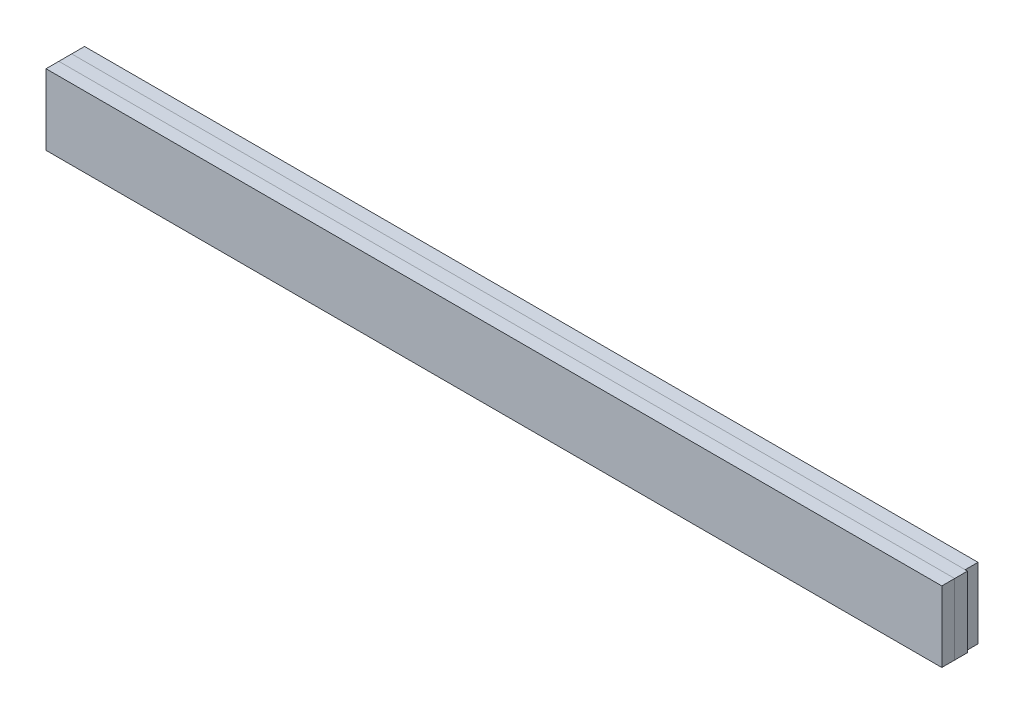
ISO-10303-21;
HEADER;
FILE_DESCRIPTION(('STEP AP214'),'2;1');
FILE_NAME('part.step','',(''),(''),'','','');
FILE_SCHEMA(('AUTOMOTIVE_DESIGN { 1 0 10303 214 1 1 1 1 }'));
ENDSEC;
DATA;
#1=APPLICATION_CONTEXT('core data for automotive mechanical design processes');
#2=APPLICATION_PROTOCOL_DEFINITION('international standard','automotive_design',2000,#1);
#3=PRODUCT_CONTEXT('',#1,'mechanical');
#4=PRODUCT('Part','Part','',(#3));
#5=PRODUCT_RELATED_PRODUCT_CATEGORY('part','',(#4));
#6=PRODUCT_DEFINITION_FORMATION('','',#4);
#7=PRODUCT_DEFINITION_CONTEXT('part definition',#1,'design');
#8=PRODUCT_DEFINITION('design','',#6,#7);
#9=PRODUCT_DEFINITION_SHAPE('','',#8);
#10=(LENGTH_UNIT() NAMED_UNIT(*) SI_UNIT(.MILLI.,.METRE.));
#11=(NAMED_UNIT(*) PLANE_ANGLE_UNIT() SI_UNIT($,.RADIAN.));
#12=(NAMED_UNIT(*) SI_UNIT($,.STERADIAN.) SOLID_ANGLE_UNIT());
#13=UNCERTAINTY_MEASURE_WITH_UNIT(LENGTH_MEASURE(1.E-05),#10,'distance_accuracy_value','');
#14=(GEOMETRIC_REPRESENTATION_CONTEXT(3) GLOBAL_UNCERTAINTY_ASSIGNED_CONTEXT((#13)) GLOBAL_UNIT_ASSIGNED_CONTEXT((#10,
#11,#12)) REPRESENTATION_CONTEXT('',''));
#15=CARTESIAN_POINT('',(0.,0.,0.));
#16=DIRECTION('',(0.,0.,1.));
#17=DIRECTION('',(1.,0.,0.));
#18=AXIS2_PLACEMENT_3D('',#15,#16,#17);
#19=CARTESIAN_POINT('',(34.667480873793,5.5,-1.5));
#20=DIRECTION('',(-1.,0.,0.));
#21=DIRECTION('',(0.,0.,1.));
#22=AXIS2_PLACEMENT_3D('',#19,#20,#21);
#23=PLANE('',#22);
#24=DIRECTION('',(0.,-1.,0.));
#25=VECTOR('',#24,1.);
#26=CARTESIAN_POINT('',(34.667480873793,5.5,-0.5));
#27=LINE('',#26,#25);
#28=CARTESIAN_POINT('',(34.667480873793,5.5,-0.5));
#29=VERTEX_POINT('',#28);
#30=CARTESIAN_POINT('',(34.667480873793,0.,-0.5));
#31=VERTEX_POINT('',#30);
#32=EDGE_CURVE('E109',#29,#31,#27,.T.);
#33=ORIENTED_EDGE('',*,*,#32,.T.);
#34=DIRECTION('',(0.,0.,1.));
#35=VECTOR('',#34,1.);
#36=CARTESIAN_POINT('',(34.667480873793,0.,-1.5));
#37=LINE('',#36,#35);
#38=CARTESIAN_POINT('',(34.667480873793,0.,-1.5));
#39=VERTEX_POINT('',#38);
#40=EDGE_CURVE('E12',#39,#31,#37,.T.);
#41=ORIENTED_EDGE('',*,*,#40,.F.);
#42=DIRECTION('',(0.,-1.,0.));
#43=VECTOR('',#42,1.);
#44=CARTESIAN_POINT('',(34.667480873793,5.5,-1.5));
#45=LINE('',#44,#43);
#46=CARTESIAN_POINT('',(34.667480873793,5.5,-1.5));
#47=VERTEX_POINT('',#46);
#48=EDGE_CURVE('E97',#47,#39,#45,.T.);
#49=ORIENTED_EDGE('',*,*,#48,.F.);
#50=DIRECTION('',(0.,0.,1.));
#51=VECTOR('',#50,1.);
#52=CARTESIAN_POINT('',(34.667480873793,5.5,-1.5));
#53=LINE('',#52,#51);
#54=EDGE_CURVE('E105',#47,#29,#53,.T.);
#55=ORIENTED_EDGE('',*,*,#54,.T.);
#56=EDGE_LOOP('',(#33,#41,#49,#55));
#57=FACE_BOUND('',#56,.T.);
#58=ADVANCED_FACE('F46',(#57),#23,.F.);
#59=CARTESIAN_POINT('',(34.667480873793,0.,-1.5));
#60=DIRECTION('',(0.,1.,0.));
#61=DIRECTION('',(0.,0.,1.));
#62=AXIS2_PLACEMENT_3D('',#59,#60,#61);
#63=PLANE('',#62);
#64=DIRECTION('',(-1.,0.,0.));
#65=VECTOR('',#64,1.);
#66=CARTESIAN_POINT('',(34.667480873793,0.,-0.5));
#67=LINE('',#66,#65);
#68=CARTESIAN_POINT('',(-34.85,0.,-0.5));
#69=VERTEX_POINT('',#68);
#70=EDGE_CURVE('E101',#31,#69,#67,.T.);
#71=ORIENTED_EDGE('',*,*,#70,.T.);
#72=DIRECTION('',(0.,0.,1.));
#73=VECTOR('',#72,1.);
#74=CARTESIAN_POINT('',(-34.85,0.,-1.5));
#75=LINE('',#74,#73);
#76=CARTESIAN_POINT('',(-34.85,0.,-1.5));
#77=VERTEX_POINT('',#76);
#78=EDGE_CURVE('E54',#77,#69,#75,.T.);
#79=ORIENTED_EDGE('',*,*,#78,.F.);
#80=DIRECTION('',(-1.,0.,0.));
#81=VECTOR('',#80,1.);
#82=CARTESIAN_POINT('',(34.667480873793,0.,-1.5));
#83=LINE('',#82,#81);
#84=EDGE_CURVE('E92',#39,#77,#83,.T.);
#85=ORIENTED_EDGE('',*,*,#84,.F.);
#86=ORIENTED_EDGE('',*,*,#40,.T.);
#87=EDGE_LOOP('',(#71,#79,#85,#86));
#88=FACE_BOUND('',#87,.T.);
#89=ADVANCED_FACE('F100',(#88),#63,.F.);
#90=CARTESIAN_POINT('',(-34.85,5.5,-1.5));
#91=DIRECTION('',(1.,0.,0.));
#92=DIRECTION('',(0.,0.,-1.));
#93=AXIS2_PLACEMENT_3D('',#90,#91,#92);
#94=PLANE('',#93);
#95=DIRECTION('',(0.,1.,0.));
#96=VECTOR('',#95,1.);
#97=CARTESIAN_POINT('',(-34.85,5.5,-0.5));
#98=LINE('',#97,#96);
#99=CARTESIAN_POINT('',(-34.85,5.5,-0.5));
#100=VERTEX_POINT('',#99);
#101=EDGE_CURVE('E79',#69,#100,#98,.T.);
#102=ORIENTED_EDGE('',*,*,#101,.T.);
#103=DIRECTION('',(0.,0.,1.));
#104=VECTOR('',#103,1.);
#105=CARTESIAN_POINT('',(-34.85,5.5,-1.5));
#106=LINE('',#105,#104);
#107=CARTESIAN_POINT('',(-34.85,5.5,-1.5));
#108=VERTEX_POINT('',#107);
#109=EDGE_CURVE('E102',#108,#100,#106,.T.);
#110=ORIENTED_EDGE('',*,*,#109,.F.);
#111=DIRECTION('',(0.,1.,0.));
#112=VECTOR('',#111,1.);
#113=CARTESIAN_POINT('',(-34.85,5.5,-1.5));
#114=LINE('',#113,#112);
#115=EDGE_CURVE('E95',#77,#108,#114,.T.);
#116=ORIENTED_EDGE('',*,*,#115,.F.);
#117=ORIENTED_EDGE('',*,*,#78,.T.);
#118=EDGE_LOOP('',(#102,#110,#116,#117));
#119=FACE_BOUND('',#118,.T.);
#120=ADVANCED_FACE('F103',(#119),#94,.F.);
#121=CARTESIAN_POINT('',(34.667480873793,5.5,-1.5));
#122=DIRECTION('',(0.,-1.,0.));
#123=DIRECTION('',(0.,0.,-1.));
#124=AXIS2_PLACEMENT_3D('',#121,#122,#123);
#125=PLANE('',#124);
#126=DIRECTION('',(1.,0.,0.));
#127=VECTOR('',#126,1.);
#128=CARTESIAN_POINT('',(34.667480873793,5.5,-0.5));
#129=LINE('',#128,#127);
#130=EDGE_CURVE('E85',#100,#29,#129,.T.);
#131=ORIENTED_EDGE('',*,*,#130,.T.);
#132=ORIENTED_EDGE('',*,*,#54,.F.);
#133=DIRECTION('',(1.,0.,0.));
#134=VECTOR('',#133,1.);
#135=CARTESIAN_POINT('',(34.667480873793,5.5,-1.5));
#136=LINE('',#135,#134);
#137=EDGE_CURVE('E62',#108,#47,#136,.T.);
#138=ORIENTED_EDGE('',*,*,#137,.F.);
#139=ORIENTED_EDGE('',*,*,#109,.T.);
#140=EDGE_LOOP('',(#131,#132,#138,#139));
#141=FACE_BOUND('',#140,.T.);
#142=ADVANCED_FACE('F116',(#141),#125,.F.);
#143=CARTESIAN_POINT('',(0.,0.,-1.5));
#144=DIRECTION('',(0.,0.,-1.));
#145=DIRECTION('',(-1.,0.,0.));
#146=AXIS2_PLACEMENT_3D('',#143,#144,#145);
#147=PLANE('',#146);
#148=ORIENTED_EDGE('',*,*,#48,.T.);
#149=ORIENTED_EDGE('',*,*,#84,.T.);
#150=ORIENTED_EDGE('',*,*,#115,.T.);
#151=ORIENTED_EDGE('',*,*,#137,.T.);
#152=EDGE_LOOP('',(#148,#149,#150,#151));
#153=FACE_BOUND('',#152,.T.);
#154=ADVANCED_FACE('F93',(#153),#147,.T.);
#155=CARTESIAN_POINT('',(0.,0.,-0.5));
#156=DIRECTION('',(0.,0.,-1.));
#157=DIRECTION('',(-1.,0.,0.));
#158=AXIS2_PLACEMENT_3D('',#155,#156,#157);
#159=PLANE('',#158);
#160=ORIENTED_EDGE('',*,*,#32,.F.);
#161=ORIENTED_EDGE('',*,*,#130,.F.);
#162=ORIENTED_EDGE('',*,*,#101,.F.);
#163=ORIENTED_EDGE('',*,*,#70,.F.);
#164=EDGE_LOOP('',(#160,#161,#162,#163));
#165=FACE_BOUND('',#164,.T.);
#166=ADVANCED_FACE('F119',(#165),#159,.F.);
#167=CLOSED_SHELL('',(#58,#89,#120,#142,#154,#166));
#168=MANIFOLD_SOLID_BREP('B2',#167);
#169=CARTESIAN_POINT('',(-34.85,5.5,1.5));
#170=DIRECTION('',(1.,0.,0.));
#171=DIRECTION('',(0.,0.,-1.));
#172=AXIS2_PLACEMENT_3D('',#169,#170,#171);
#173=PLANE('',#172);
#174=DIRECTION('',(0.,-1.,0.));
#175=VECTOR('',#174,1.);
#176=CARTESIAN_POINT('',(-34.85,5.5,0.5));
#177=LINE('',#176,#175);
#178=CARTESIAN_POINT('',(-34.85,5.5,0.5));
#179=VERTEX_POINT('',#178);
#180=CARTESIAN_POINT('',(-34.85,0.,0.5));
#181=VERTEX_POINT('',#180);
#182=EDGE_CURVE('E242',#179,#181,#177,.T.);
#183=ORIENTED_EDGE('',*,*,#182,.T.);
#184=DIRECTION('',(0.,0.,-1.));
#185=VECTOR('',#184,1.);
#186=CARTESIAN_POINT('',(-34.85,0.,1.5));
#187=LINE('',#186,#185);
#188=CARTESIAN_POINT('',(-34.85,0.,1.5));
#189=VERTEX_POINT('',#188);
#190=EDGE_CURVE('E44',#189,#181,#187,.T.);
#191=ORIENTED_EDGE('',*,*,#190,.F.);
#192=DIRECTION('',(0.,-1.,0.));
#193=VECTOR('',#192,1.);
#194=CARTESIAN_POINT('',(-34.85,5.5,1.5));
#195=LINE('',#194,#193);
#196=CARTESIAN_POINT('',(-34.85,5.5,1.5));
#197=VERTEX_POINT('',#196);
#198=EDGE_CURVE('E230',#197,#189,#195,.T.);
#199=ORIENTED_EDGE('',*,*,#198,.F.);
#200=DIRECTION('',(0.,0.,-1.));
#201=VECTOR('',#200,1.);
#202=CARTESIAN_POINT('',(-34.85,5.5,1.5));
#203=LINE('',#202,#201);
#204=EDGE_CURVE('E238',#197,#179,#203,.T.);
#205=ORIENTED_EDGE('',*,*,#204,.T.);
#206=EDGE_LOOP('',(#183,#191,#199,#205));
#207=FACE_BOUND('',#206,.T.);
#208=ADVANCED_FACE('F179',(#207),#173,.F.);
#209=CARTESIAN_POINT('',(-34.85,0.,1.5));
#210=DIRECTION('',(0.,1.,0.));
#211=DIRECTION('',(0.,0.,1.));
#212=AXIS2_PLACEMENT_3D('',#209,#210,#211);
#213=PLANE('',#212);
#214=DIRECTION('',(1.,0.,0.));
#215=VECTOR('',#214,1.);
#216=CARTESIAN_POINT('',(-34.85,0.,0.5));
#217=LINE('',#216,#215);
#218=CARTESIAN_POINT('',(34.85,0.,0.5));
#219=VERTEX_POINT('',#218);
#220=EDGE_CURVE('E234',#181,#219,#217,.T.);
#221=ORIENTED_EDGE('',*,*,#220,.T.);
#222=DIRECTION('',(0.,0.,-1.));
#223=VECTOR('',#222,1.);
#224=CARTESIAN_POINT('',(34.85,0.,1.5));
#225=LINE('',#224,#223);
#226=CARTESIAN_POINT('',(34.85,0.,1.5));
#227=VERTEX_POINT('',#226);
#228=EDGE_CURVE('E187',#227,#219,#225,.T.);
#229=ORIENTED_EDGE('',*,*,#228,.F.);
#230=DIRECTION('',(1.,0.,0.));
#231=VECTOR('',#230,1.);
#232=CARTESIAN_POINT('',(-34.85,0.,1.5));
#233=LINE('',#232,#231);
#234=EDGE_CURVE('E225',#189,#227,#233,.T.);
#235=ORIENTED_EDGE('',*,*,#234,.F.);
#236=ORIENTED_EDGE('',*,*,#190,.T.);
#237=EDGE_LOOP('',(#221,#229,#235,#236));
#238=FACE_BOUND('',#237,.T.);
#239=ADVANCED_FACE('F233',(#238),#213,.F.);
#240=CARTESIAN_POINT('',(34.85,5.5,1.5));
#241=DIRECTION('',(-1.,0.,0.));
#242=DIRECTION('',(0.,0.,1.));
#243=AXIS2_PLACEMENT_3D('',#240,#241,#242);
#244=PLANE('',#243);
#245=DIRECTION('',(0.,1.,0.));
#246=VECTOR('',#245,1.);
#247=CARTESIAN_POINT('',(34.85,5.5,0.5));
#248=LINE('',#247,#246);
#249=CARTESIAN_POINT('',(34.85,5.5,0.5));
#250=VERTEX_POINT('',#249);
#251=EDGE_CURVE('E212',#219,#250,#248,.T.);
#252=ORIENTED_EDGE('',*,*,#251,.T.);
#253=DIRECTION('',(0.,0.,-1.));
#254=VECTOR('',#253,1.);
#255=CARTESIAN_POINT('',(34.85,5.5,1.5));
#256=LINE('',#255,#254);
#257=CARTESIAN_POINT('',(34.85,5.5,1.5));
#258=VERTEX_POINT('',#257);
#259=EDGE_CURVE('E235',#258,#250,#256,.T.);
#260=ORIENTED_EDGE('',*,*,#259,.F.);
#261=DIRECTION('',(0.,1.,0.));
#262=VECTOR('',#261,1.);
#263=CARTESIAN_POINT('',(34.85,5.5,1.5));
#264=LINE('',#263,#262);
#265=EDGE_CURVE('E228',#227,#258,#264,.T.);
#266=ORIENTED_EDGE('',*,*,#265,.F.);
#267=ORIENTED_EDGE('',*,*,#228,.T.);
#268=EDGE_LOOP('',(#252,#260,#266,#267));
#269=FACE_BOUND('',#268,.T.);
#270=ADVANCED_FACE('F236',(#269),#244,.F.);
#271=CARTESIAN_POINT('',(-34.85,5.5,1.5));
#272=DIRECTION('',(0.,-1.,0.));
#273=DIRECTION('',(0.,0.,-1.));
#274=AXIS2_PLACEMENT_3D('',#271,#272,#273);
#275=PLANE('',#274);
#276=DIRECTION('',(-1.,0.,0.));
#277=VECTOR('',#276,1.);
#278=CARTESIAN_POINT('',(-34.85,5.5,0.5));
#279=LINE('',#278,#277);
#280=EDGE_CURVE('E218',#250,#179,#279,.T.);
#281=ORIENTED_EDGE('',*,*,#280,.T.);
#282=ORIENTED_EDGE('',*,*,#204,.F.);
#283=DIRECTION('',(-1.,0.,0.));
#284=VECTOR('',#283,1.);
#285=CARTESIAN_POINT('',(-34.85,5.5,1.5));
#286=LINE('',#285,#284);
#287=EDGE_CURVE('E195',#258,#197,#286,.T.);
#288=ORIENTED_EDGE('',*,*,#287,.F.);
#289=ORIENTED_EDGE('',*,*,#259,.T.);
#290=EDGE_LOOP('',(#281,#282,#288,#289));
#291=FACE_BOUND('',#290,.T.);
#292=ADVANCED_FACE('F249',(#291),#275,.F.);
#293=CARTESIAN_POINT('',(0.,0.,1.5));
#294=DIRECTION('',(0.,0.,1.));
#295=DIRECTION('',(1.,0.,0.));
#296=AXIS2_PLACEMENT_3D('',#293,#294,#295);
#297=PLANE('',#296);
#298=ORIENTED_EDGE('',*,*,#198,.T.);
#299=ORIENTED_EDGE('',*,*,#234,.T.);
#300=ORIENTED_EDGE('',*,*,#265,.T.);
#301=ORIENTED_EDGE('',*,*,#287,.T.);
#302=EDGE_LOOP('',(#298,#299,#300,#301));
#303=FACE_BOUND('',#302,.T.);
#304=ADVANCED_FACE('F226',(#303),#297,.T.);
#305=CARTESIAN_POINT('',(0.,0.,0.5));
#306=DIRECTION('',(0.,0.,1.));
#307=DIRECTION('',(1.,0.,0.));
#308=AXIS2_PLACEMENT_3D('',#305,#306,#307);
#309=PLANE('',#308);
#310=ORIENTED_EDGE('',*,*,#182,.F.);
#311=ORIENTED_EDGE('',*,*,#280,.F.);
#312=ORIENTED_EDGE('',*,*,#251,.F.);
#313=ORIENTED_EDGE('',*,*,#220,.F.);
#314=EDGE_LOOP('',(#310,#311,#312,#313));
#315=FACE_BOUND('',#314,.T.);
#316=ADVANCED_FACE('F252',(#315),#309,.F.);
#317=CLOSED_SHELL('',(#208,#239,#270,#292,#304,#316));
#318=MANIFOLD_SOLID_BREP('B6',#317);
#319=CARTESIAN_POINT('',(-34.85,5.5,0.5));
#320=DIRECTION('',(1.,0.,0.));
#321=DIRECTION('',(0.,0.,-1.));
#322=AXIS2_PLACEMENT_3D('',#319,#320,#321);
#323=PLANE('',#322);
#324=DIRECTION('',(0.,-1.,0.));
#325=VECTOR('',#324,1.);
#326=CARTESIAN_POINT('',(-34.85,5.5,-0.5));
#327=LINE('',#326,#325);
#328=CARTESIAN_POINT('',(-34.85,5.5,-0.5));
#329=VERTEX_POINT('',#328);
#330=CARTESIAN_POINT('',(-34.85,0.,-0.5));
#331=VERTEX_POINT('',#330);
#332=EDGE_CURVE('E366',#329,#331,#327,.T.);
#333=ORIENTED_EDGE('',*,*,#332,.T.);
#334=DIRECTION('',(0.,0.,-1.));
#335=VECTOR('',#334,1.);
#336=CARTESIAN_POINT('',(-34.85,0.,0.5));
#337=LINE('',#336,#335);
#338=CARTESIAN_POINT('',(-34.85,0.,0.5));
#339=VERTEX_POINT('',#338);
#340=EDGE_CURVE('E177',#339,#331,#337,.T.);
#341=ORIENTED_EDGE('',*,*,#340,.F.);
#342=DIRECTION('',(0.,-1.,0.));
#343=VECTOR('',#342,1.);
#344=CARTESIAN_POINT('',(-34.85,5.5,0.5));
#345=LINE('',#344,#343);
#346=CARTESIAN_POINT('',(-34.85,5.5,0.5));
#347=VERTEX_POINT('',#346);
#348=EDGE_CURVE('E354',#347,#339,#345,.T.);
#349=ORIENTED_EDGE('',*,*,#348,.F.);
#350=DIRECTION('',(0.,0.,-1.));
#351=VECTOR('',#350,1.);
#352=CARTESIAN_POINT('',(-34.85,5.5,0.5));
#353=LINE('',#352,#351);
#354=EDGE_CURVE('E362',#347,#329,#353,.T.);
#355=ORIENTED_EDGE('',*,*,#354,.T.);
#356=EDGE_LOOP('',(#333,#341,#349,#355));
#357=FACE_BOUND('',#356,.T.);
#358=ADVANCED_FACE('F303',(#357),#323,.F.);
#359=CARTESIAN_POINT('',(-34.85,0.,0.5));
#360=DIRECTION('',(0.,1.,0.));
#361=DIRECTION('',(0.,0.,1.));
#362=AXIS2_PLACEMENT_3D('',#359,#360,#361);
#363=PLANE('',#362);
#364=DIRECTION('',(1.,0.,0.));
#365=VECTOR('',#364,1.);
#366=CARTESIAN_POINT('',(-34.85,0.,-0.5));
#367=LINE('',#366,#365);
#368=CARTESIAN_POINT('',(34.85,0.,-0.5));
#369=VERTEX_POINT('',#368);
#370=EDGE_CURVE('E358',#331,#369,#367,.T.);
#371=ORIENTED_EDGE('',*,*,#370,.T.);
#372=DIRECTION('',(0.,0.,-1.));
#373=VECTOR('',#372,1.);
#374=CARTESIAN_POINT('',(34.85,0.,0.5));
#375=LINE('',#374,#373);
#376=CARTESIAN_POINT('',(34.85,0.,0.5));
#377=VERTEX_POINT('',#376);
#378=EDGE_CURVE('E311',#377,#369,#375,.T.);
#379=ORIENTED_EDGE('',*,*,#378,.F.);
#380=DIRECTION('',(1.,0.,0.));
#381=VECTOR('',#380,1.);
#382=CARTESIAN_POINT('',(-34.85,0.,0.5));
#383=LINE('',#382,#381);
#384=EDGE_CURVE('E349',#339,#377,#383,.T.);
#385=ORIENTED_EDGE('',*,*,#384,.F.);
#386=ORIENTED_EDGE('',*,*,#340,.T.);
#387=EDGE_LOOP('',(#371,#379,#385,#386));
#388=FACE_BOUND('',#387,.T.);
#389=ADVANCED_FACE('F357',(#388),#363,.F.);
#390=CARTESIAN_POINT('',(34.85,5.5,0.5));
#391=DIRECTION('',(-1.,0.,0.));
#392=DIRECTION('',(0.,0.,1.));
#393=AXIS2_PLACEMENT_3D('',#390,#391,#392);
#394=PLANE('',#393);
#395=DIRECTION('',(0.,1.,0.));
#396=VECTOR('',#395,1.);
#397=CARTESIAN_POINT('',(34.85,5.5,-0.5));
#398=LINE('',#397,#396);
#399=CARTESIAN_POINT('',(34.85,5.5,-0.5));
#400=VERTEX_POINT('',#399);
#401=EDGE_CURVE('E336',#369,#400,#398,.T.);
#402=ORIENTED_EDGE('',*,*,#401,.T.);
#403=DIRECTION('',(0.,0.,-1.));
#404=VECTOR('',#403,1.);
#405=CARTESIAN_POINT('',(34.85,5.5,0.5));
#406=LINE('',#405,#404);
#407=CARTESIAN_POINT('',(34.85,5.5,0.5));
#408=VERTEX_POINT('',#407);
#409=EDGE_CURVE('E359',#408,#400,#406,.T.);
#410=ORIENTED_EDGE('',*,*,#409,.F.);
#411=DIRECTION('',(0.,1.,0.));
#412=VECTOR('',#411,1.);
#413=CARTESIAN_POINT('',(34.85,5.5,0.5));
#414=LINE('',#413,#412);
#415=EDGE_CURVE('E352',#377,#408,#414,.T.);
#416=ORIENTED_EDGE('',*,*,#415,.F.);
#417=ORIENTED_EDGE('',*,*,#378,.T.);
#418=EDGE_LOOP('',(#402,#410,#416,#417));
#419=FACE_BOUND('',#418,.T.);
#420=ADVANCED_FACE('F360',(#419),#394,.F.);
#421=CARTESIAN_POINT('',(-34.85,5.5,0.5));
#422=DIRECTION('',(0.,-1.,0.));
#423=DIRECTION('',(0.,0.,-1.));
#424=AXIS2_PLACEMENT_3D('',#421,#422,#423);
#425=PLANE('',#424);
#426=DIRECTION('',(-1.,0.,0.));
#427=VECTOR('',#426,1.);
#428=CARTESIAN_POINT('',(-34.85,5.5,-0.5));
#429=LINE('',#428,#427);
#430=EDGE_CURVE('E342',#400,#329,#429,.T.);
#431=ORIENTED_EDGE('',*,*,#430,.T.);
#432=ORIENTED_EDGE('',*,*,#354,.F.);
#433=DIRECTION('',(-1.,0.,0.));
#434=VECTOR('',#433,1.);
#435=CARTESIAN_POINT('',(-34.85,5.5,0.5));
#436=LINE('',#435,#434);
#437=EDGE_CURVE('E319',#408,#347,#436,.T.);
#438=ORIENTED_EDGE('',*,*,#437,.F.);
#439=ORIENTED_EDGE('',*,*,#409,.T.);
#440=EDGE_LOOP('',(#431,#432,#438,#439));
#441=FACE_BOUND('',#440,.T.);
#442=ADVANCED_FACE('F373',(#441),#425,.F.);
#443=CARTESIAN_POINT('',(0.,0.,0.5));
#444=DIRECTION('',(0.,0.,1.));
#445=DIRECTION('',(1.,0.,0.));
#446=AXIS2_PLACEMENT_3D('',#443,#444,#445);
#447=PLANE('',#446);
#448=ORIENTED_EDGE('',*,*,#348,.T.);
#449=ORIENTED_EDGE('',*,*,#384,.T.);
#450=ORIENTED_EDGE('',*,*,#415,.T.);
#451=ORIENTED_EDGE('',*,*,#437,.T.);
#452=EDGE_LOOP('',(#448,#449,#450,#451));
#453=FACE_BOUND('',#452,.T.);
#454=ADVANCED_FACE('F350',(#453),#447,.T.);
#455=CARTESIAN_POINT('',(0.,0.,-0.5));
#456=DIRECTION('',(0.,0.,1.));
#457=DIRECTION('',(1.,0.,0.));
#458=AXIS2_PLACEMENT_3D('',#455,#456,#457);
#459=PLANE('',#458);
#460=ORIENTED_EDGE('',*,*,#332,.F.);
#461=ORIENTED_EDGE('',*,*,#430,.F.);
#462=ORIENTED_EDGE('',*,*,#401,.F.);
#463=ORIENTED_EDGE('',*,*,#370,.F.);
#464=EDGE_LOOP('',(#460,#461,#462,#463));
#465=FACE_BOUND('',#464,.T.);
#466=ADVANCED_FACE('F376',(#465),#459,.F.);
#467=CLOSED_SHELL('',(#358,#389,#420,#442,#454,#466));
#468=MANIFOLD_SOLID_BREP('B38',#467);
#469=ADVANCED_BREP_SHAPE_REPRESENTATION('',(#18,#168,#318,#468),#14);
#470=SHAPE_DEFINITION_REPRESENTATION(#9,#469);
ENDSEC;
END-ISO-10303-21;
